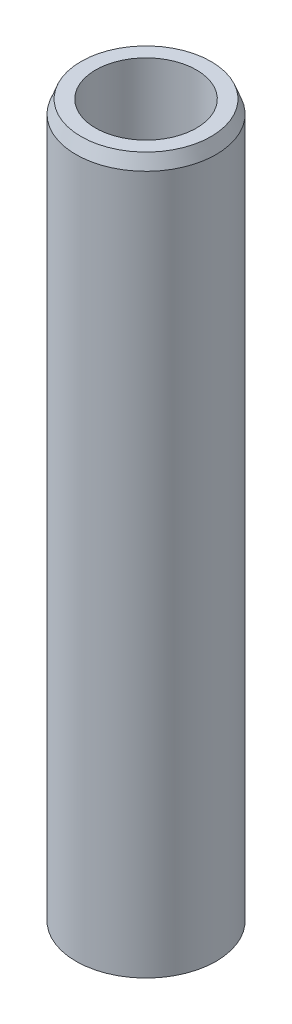
ISO-10303-21;
HEADER;
FILE_DESCRIPTION(('STEP AP214'),'2;1');
FILE_NAME('part.step','',(''),(''),'','','');
FILE_SCHEMA(('AUTOMOTIVE_DESIGN { 1 0 10303 214 1 1 1 1 }'));
ENDSEC;
DATA;
#1=APPLICATION_CONTEXT('core data for automotive mechanical design processes');
#2=APPLICATION_PROTOCOL_DEFINITION('international standard','automotive_design',2000,#1);
#3=PRODUCT_CONTEXT('',#1,'mechanical');
#4=PRODUCT('Part','Part','',(#3));
#5=PRODUCT_RELATED_PRODUCT_CATEGORY('part','',(#4));
#6=PRODUCT_DEFINITION_FORMATION('','',#4);
#7=PRODUCT_DEFINITION_CONTEXT('part definition',#1,'design');
#8=PRODUCT_DEFINITION('design','',#6,#7);
#9=PRODUCT_DEFINITION_SHAPE('','',#8);
#10=(LENGTH_UNIT() NAMED_UNIT(*) SI_UNIT(.MILLI.,.METRE.));
#11=(NAMED_UNIT(*) PLANE_ANGLE_UNIT() SI_UNIT($,.RADIAN.));
#12=(NAMED_UNIT(*) SI_UNIT($,.STERADIAN.) SOLID_ANGLE_UNIT());
#13=UNCERTAINTY_MEASURE_WITH_UNIT(LENGTH_MEASURE(1.E-05),#10,'distance_accuracy_value','');
#14=(GEOMETRIC_REPRESENTATION_CONTEXT(3) GLOBAL_UNCERTAINTY_ASSIGNED_CONTEXT((#13)) GLOBAL_UNIT_ASSIGNED_CONTEXT((#10,
#11,#12)) REPRESENTATION_CONTEXT('',''));
#15=CARTESIAN_POINT('',(0.,0.,0.));
#16=DIRECTION('',(0.,0.,1.));
#17=DIRECTION('',(1.,0.,0.));
#18=AXIS2_PLACEMENT_3D('',#15,#16,#17);
#19=CARTESIAN_POINT('',(0.,204.632580053421,0.));
#20=DIRECTION('',(0.,-1.,0.));
#21=DIRECTION('',(0.,0.,-1.));
#22=AXIS2_PLACEMENT_3D('',#19,#20,#21);
#23=CYLINDRICAL_SURFACE('',#22,20.);
#24=CARTESIAN_POINT('',(0.,200.891519500774,0.));
#25=DIRECTION('',(0.,1.,0.));
#26=DIRECTION('',(0.,0.,1.));
#27=AXIS2_PLACEMENT_3D('',#24,#25,#26);
#28=CIRCLE('',#27,20.);
#29=CARTESIAN_POINT('',(0.,200.891519500774,-20.));
#30=VERTEX_POINT('',#29);
#31=EDGE_CURVE('E50',#30,#30,#28,.F.);
#32=CARTESIAN_POINT('',(0.,1.43430570135733,0.));
#33=DIRECTION('',(0.,1.,0.));
#34=DIRECTION('',(0.,0.,1.));
#35=AXIS2_PLACEMENT_3D('',#32,#33,#34);
#36=CIRCLE('',#35,20.);
#37=CARTESIAN_POINT('',(0.,1.43430570135733,-20.));
#38=VERTEX_POINT('',#37);
#39=EDGE_CURVE('E51',#38,#38,#36,.T.);
#40=CARTESIAN_POINT('',(0.,200.891519500774,-20.));
#41=CARTESIAN_POINT('',(0.,198.813840190363,-20.));
#42=CARTESIAN_POINT('',(0.,196.736160879953,-20.));
#43=CARTESIAN_POINT('',(0.,192.580802259132,-20.));
#44=CARTESIAN_POINT('',(0.,190.503122948721,-20.));
#45=CARTESIAN_POINT('',(0.,186.3477643279,-20.));
#46=CARTESIAN_POINT('',(0.,184.270085017489,-20.));
#47=CARTESIAN_POINT('',(0.,180.114726396668,-20.));
#48=CARTESIAN_POINT('',(0.,178.037047086258,-20.));
#49=CARTESIAN_POINT('',(0.,173.881688465436,-20.));
#50=CARTESIAN_POINT('',(0.,171.804009155026,-20.));
#51=CARTESIAN_POINT('',(0.,167.648650534205,-20.));
#52=CARTESIAN_POINT('',(0.,165.570971223794,-20.));
#53=CARTESIAN_POINT('',(0.,161.415612602973,-20.));
#54=CARTESIAN_POINT('',(0.,159.337933292562,-20.));
#55=CARTESIAN_POINT('',(0.,155.182574671741,-20.));
#56=CARTESIAN_POINT('',(0.,153.10489536133,-20.));
#57=CARTESIAN_POINT('',(0.,148.949536740509,-20.));
#58=CARTESIAN_POINT('',(0.,146.871857430099,-20.));
#59=CARTESIAN_POINT('',(0.,142.716498809278,-20.));
#60=CARTESIAN_POINT('',(0.,140.638819498867,-20.));
#61=CARTESIAN_POINT('',(0.,136.483460878046,-20.));
#62=CARTESIAN_POINT('',(0.,134.405781567635,-20.));
#63=CARTESIAN_POINT('',(0.,130.250422946814,-20.));
#64=CARTESIAN_POINT('',(0.,128.172743636403,-20.));
#65=CARTESIAN_POINT('',(0.,124.017385015582,-20.));
#66=CARTESIAN_POINT('',(0.,121.939705705172,-20.));
#67=CARTESIAN_POINT('',(0.,117.78434708435,-20.));
#68=CARTESIAN_POINT('',(0.,115.70666777394,-20.));
#69=CARTESIAN_POINT('',(0.,111.551309153119,-20.));
#70=CARTESIAN_POINT('',(0.,109.473629842708,-20.));
#71=CARTESIAN_POINT('',(0.,105.318271221887,-20.));
#72=CARTESIAN_POINT('',(0.,103.240591911476,-20.));
#73=CARTESIAN_POINT('',(0.,99.0852332906551,-20.));
#74=CARTESIAN_POINT('',(0.,97.0075539802445,-20.));
#75=CARTESIAN_POINT('',(0.,92.8521953594233,-20.));
#76=CARTESIAN_POINT('',(0.,90.7745160490127,-20.));
#77=CARTESIAN_POINT('',(0.,86.6191574281916,-20.));
#78=CARTESIAN_POINT('',(0.,84.541478117781,-20.));
#79=CARTESIAN_POINT('',(0.,80.3861194969598,-20.));
#80=CARTESIAN_POINT('',(0.,78.3084401865492,-20.));
#81=CARTESIAN_POINT('',(0.,74.153081565728,-20.));
#82=CARTESIAN_POINT('',(0.,72.0754022553174,-20.));
#83=CARTESIAN_POINT('',(0.,67.9200436344962,-20.));
#84=CARTESIAN_POINT('',(0.,65.8423643240857,-20.));
#85=CARTESIAN_POINT('',(0.,61.6870057032645,-20.));
#86=CARTESIAN_POINT('',(0.,59.6093263928539,-20.));
#87=CARTESIAN_POINT('',(0.,55.4539677720327,-20.));
#88=CARTESIAN_POINT('',(0.,53.3762884616221,-20.));
#89=CARTESIAN_POINT('',(0.,49.2209298408009,-20.));
#90=CARTESIAN_POINT('',(0.,47.1432505303903,-20.));
#91=CARTESIAN_POINT('',(0.,42.9878919095691,-20.));
#92=CARTESIAN_POINT('',(0.,40.9102125991586,-20.));
#93=CARTESIAN_POINT('',(0.,36.7548539783374,-20.));
#94=CARTESIAN_POINT('',(0.,34.6771746679268,-20.));
#95=CARTESIAN_POINT('',(0.,30.5218160471056,-20.));
#96=CARTESIAN_POINT('',(0.,28.444136736695,-20.));
#97=CARTESIAN_POINT('',(0.,24.2887781158738,-20.));
#98=CARTESIAN_POINT('',(0.,22.2110988054632,-20.));
#99=CARTESIAN_POINT('',(0.,18.0557401846421,-20.));
#100=CARTESIAN_POINT('',(0.,15.9780608742315,-20.));
#101=CARTESIAN_POINT('',(0.,11.8227022534103,-20.));
#102=CARTESIAN_POINT('',(0.,9.7450229429997,-20.));
#103=CARTESIAN_POINT('',(0.,5.58966432217852,-20.));
#104=CARTESIAN_POINT('',(0.,3.51198501176792,-20.));
#105=CARTESIAN_POINT('',(0.,1.43430570135733,-20.));
#106=B_SPLINE_CURVE_WITH_KNOTS('',3,(#40,#41,#42,#43,#44,#45,#46,#47,#48,#49,#50,#51,#52,#53,
#54,#55,#56,#57,#58,#59,#60,#61,#62,#63,#64,#65,#66,#67,#68,#69,#70,#71,#72,#73,#74,#75,#76,#77,
#78,#79,#80,#81,#82,#83,#84,#85,#86,#87,#88,#89,#90,#91,#92,#93,#94,#95,#96,#97,#98,#99,#100,
#101,#102,#103,#104,#105),.UNSPECIFIED.,.F.,.F.,(4,2,2,2,2,2,2,2,2,2,2,2,2,2,2,2,2,2,2,2,2,2,2,
2,2,2,2,2,2,2,2,2,4),(0.,6.23303793123176,12.4660758624635,18.6991137936953,24.9321517249271,
31.1651896561589,37.3982275873906,43.6312655186224,49.8643034498542,56.0973413810859,
62.3303793123177,68.5634172435495,74.7964551747813,81.029493106013,87.2625310372448,
93.4955689684766,99.7286068997083,105.96164483094,112.194682762172,118.427720693404,
124.660758624635,130.893796555867,137.126834487099,143.359872418331,149.592910349563,
155.825948280794,162.058986212026,168.292024143258,174.52506207449,180.758100005721,
186.991137936953,193.224175868185,199.457213799417),.UNSPECIFIED.);
#107=EDGE_CURVE('BSEAM39',#30,#38,#106,.T.);
#108=ORIENTED_EDGE('',*,*,#31,.T.);
#109=ORIENTED_EDGE('',*,*,#39,.T.);
#110=ORIENTED_EDGE('',*,*,#107,.T.);
#111=ORIENTED_EDGE('',*,*,#107,.F.);
#112=EDGE_LOOP('',(#108,#110,#109,#111));
#113=FACE_BOUND('',#112,.T.);
#114=ADVANCED_FACE('F39',(#113),#23,.T.);
#115=CARTESIAN_POINT('',(0.,204.632580053421,0.));
#116=DIRECTION('',(0.,1.,0.));
#117=DIRECTION('',(0.,0.,1.));
#118=AXIS2_PLACEMENT_3D('',#115,#116,#117);
#119=PLANE('',#118);
#120=CARTESIAN_POINT('',(0.,204.632580053421,0.));
#121=DIRECTION('',(0.,1.,0.));
#122=DIRECTION('',(0.,0.,1.));
#123=AXIS2_PLACEMENT_3D('',#120,#121,#122);
#124=CIRCLE('',#123,18.5656942986428);
#125=CARTESIAN_POINT('',(0.,204.632580053421,18.5656942986428));
#126=VERTEX_POINT('',#125);
#127=EDGE_CURVE('E54',#126,#126,#124,.T.);
#128=ORIENTED_EDGE('',*,*,#127,.T.);
#129=EDGE_LOOP('',(#128));
#130=FACE_BOUND('',#129,.T.);
#131=CARTESIAN_POINT('',(0.,204.632580053421,0.));
#132=DIRECTION('',(0.,1.,0.));
#133=DIRECTION('',(0.,0.,1.));
#134=AXIS2_PLACEMENT_3D('',#131,#132,#133);
#135=CIRCLE('',#134,14.3952246288773);
#136=CARTESIAN_POINT('',(0.,204.632580053421,-14.3952246288773));
#137=VERTEX_POINT('',#136);
#138=EDGE_CURVE('E58',#137,#137,#135,.T.);
#139=ORIENTED_EDGE('',*,*,#138,.F.);
#140=EDGE_LOOP('',(#139));
#141=FACE_BOUND('',#140,.T.);
#142=ADVANCED_FACE('F69',(#130,#141),#119,.T.);
#143=CARTESIAN_POINT('',(0.,0.,0.));
#144=DIRECTION('',(0.,1.,0.));
#145=DIRECTION('',(0.,0.,1.));
#146=AXIS2_PLACEMENT_3D('',#143,#144,#145);
#147=PLANE('',#146);
#148=CARTESIAN_POINT('',(0.,0.,0.));
#149=DIRECTION('',(0.,1.,0.));
#150=DIRECTION('',(0.,0.,1.));
#151=AXIS2_PLACEMENT_3D('',#148,#149,#150);
#152=CIRCLE('',#151,16.2589394473524);
#153=CARTESIAN_POINT('',(0.,0.,16.2589394473524));
#154=VERTEX_POINT('',#153);
#155=EDGE_CURVE('E10',#154,#154,#152,.F.);
#156=ORIENTED_EDGE('',*,*,#155,.T.);
#157=EDGE_LOOP('',(#156));
#158=FACE_BOUND('',#157,.T.);
#159=CARTESIAN_POINT('',(0.,0.,0.));
#160=DIRECTION('',(0.,1.,0.));
#161=DIRECTION('',(0.,0.,1.));
#162=AXIS2_PLACEMENT_3D('',#159,#160,#161);
#163=CIRCLE('',#162,14.3952246288773);
#164=CARTESIAN_POINT('',(0.,0.,-14.3952246288773));
#165=VERTEX_POINT('',#164);
#166=EDGE_CURVE('E63',#165,#165,#163,.T.);
#167=ORIENTED_EDGE('',*,*,#166,.T.);
#168=EDGE_LOOP('',(#167));
#169=FACE_BOUND('',#168,.T.);
#170=ADVANCED_FACE('F75',(#158,#169),#147,.F.);
#171=CARTESIAN_POINT('',(0.,204.632580053421,0.));
#172=DIRECTION('',(0.,-1.,0.));
#173=DIRECTION('',(0.,0.,-1.));
#174=AXIS2_PLACEMENT_3D('',#171,#172,#173);
#175=CYLINDRICAL_SURFACE('',#174,14.3952246288773);
#176=CARTESIAN_POINT('',(0.,204.632580053421,-14.3952246288773));
#177=CARTESIAN_POINT('',(0.,202.500990677865,-14.3952246288773));
#178=CARTESIAN_POINT('',(0.,200.369401302308,-14.3952246288773));
#179=CARTESIAN_POINT('',(0.,196.106222551195,-14.3952246288773));
#180=CARTESIAN_POINT('',(0.,193.974633175639,-14.3952246288773));
#181=CARTESIAN_POINT('',(0.,189.711454424526,-14.3952246288773));
#182=CARTESIAN_POINT('',(0.,187.579865048969,-14.3952246288773));
#183=CARTESIAN_POINT('',(0.,183.316686297856,-14.3952246288773));
#184=CARTESIAN_POINT('',(0.,181.1850969223,-14.3952246288773));
#185=CARTESIAN_POINT('',(0.,176.921918171187,-14.3952246288773));
#186=CARTESIAN_POINT('',(0.,174.790328795631,-14.3952246288773));
#187=CARTESIAN_POINT('',(0.,170.527150044518,-14.3952246288773));
#188=CARTESIAN_POINT('',(0.,168.395560668961,-14.3952246288773));
#189=CARTESIAN_POINT('',(0.,164.132381917848,-14.3952246288773));
#190=CARTESIAN_POINT('',(0.,162.000792542292,-14.3952246288773));
#191=CARTESIAN_POINT('',(0.,157.737613791179,-14.3952246288773));
#192=CARTESIAN_POINT('',(0.,155.606024415622,-14.3952246288773));
#193=CARTESIAN_POINT('',(0.,151.342845664509,-14.3952246288773));
#194=CARTESIAN_POINT('',(0.,149.211256288953,-14.3952246288773));
#195=CARTESIAN_POINT('',(0.,144.94807753784,-14.3952246288773));
#196=CARTESIAN_POINT('',(0.,142.816488162284,-14.3952246288773));
#197=CARTESIAN_POINT('',(0.,138.553309411171,-14.3952246288773));
#198=CARTESIAN_POINT('',(0.,136.421720035614,-14.3952246288773));
#199=CARTESIAN_POINT('',(0.,132.158541284501,-14.3952246288773));
#200=CARTESIAN_POINT('',(0.,130.026951908945,-14.3952246288773));
#201=CARTESIAN_POINT('',(0.,125.763773157832,-14.3952246288773));
#202=CARTESIAN_POINT('',(0.,123.632183782275,-14.3952246288773));
#203=CARTESIAN_POINT('',(0.,119.369005031162,-14.3952246288773));
#204=CARTESIAN_POINT('',(0.,117.237415655606,-14.3952246288773));
#205=CARTESIAN_POINT('',(0.,112.974236904493,-14.3952246288773));
#206=CARTESIAN_POINT('',(0.,110.842647528936,-14.3952246288773));
#207=CARTESIAN_POINT('',(0.,106.579468777824,-14.3952246288773));
#208=CARTESIAN_POINT('',(0.,104.447879402267,-14.3952246288773));
#209=CARTESIAN_POINT('',(0.,100.184700651154,-14.3952246288773));
#210=CARTESIAN_POINT('',(0.,98.0531112755977,-14.3952246288773));
#211=CARTESIAN_POINT('',(0.,93.7899325244847,-14.3952246288773));
#212=CARTESIAN_POINT('',(0.,91.6583431489283,-14.3952246288773));
#213=CARTESIAN_POINT('',(0.,87.3951643978153,-14.3952246288773));
#214=CARTESIAN_POINT('',(0.,85.2635750222588,-14.3952246288773));
#215=CARTESIAN_POINT('',(0.,81.0003962711459,-14.3952246288773));
#216=CARTESIAN_POINT('',(0.,78.8688068955894,-14.3952246288773));
#217=CARTESIAN_POINT('',(0.,74.6056281444765,-14.3952246288773));
#218=CARTESIAN_POINT('',(0.,72.47403876892,-14.3952246288773));
#219=CARTESIAN_POINT('',(0.,68.2108600178071,-14.3952246288773));
#220=CARTESIAN_POINT('',(0.,66.0792706422506,-14.3952246288773));
#221=CARTESIAN_POINT('',(0.,61.8160918911376,-14.3952246288773));
#222=CARTESIAN_POINT('',(0.,59.6845025155812,-14.3952246288773));
#223=CARTESIAN_POINT('',(0.,55.4213237644682,-14.3952246288773));
#224=CARTESIAN_POINT('',(0.,53.2897343889118,-14.3952246288773));
#225=CARTESIAN_POINT('',(0.,49.0265556377988,-14.3952246288773));
#226=CARTESIAN_POINT('',(0.,46.8949662622424,-14.3952246288773));
#227=CARTESIAN_POINT('',(0.,42.6317875111294,-14.3952246288773));
#228=CARTESIAN_POINT('',(0.,40.5001981355729,-14.3952246288773));
#229=CARTESIAN_POINT('',(0.,36.23701938446,-14.3952246288773));
#230=CARTESIAN_POINT('',(0.,34.1054300089035,-14.3952246288773));
#231=CARTESIAN_POINT('',(0.,29.8422512577906,-14.3952246288773));
#232=CARTESIAN_POINT('',(0.,27.7106618822341,-14.3952246288773));
#233=CARTESIAN_POINT('',(0.,23.4474831311212,-14.3952246288773));
#234=CARTESIAN_POINT('',(0.,21.3158937555647,-14.3952246288773));
#235=CARTESIAN_POINT('',(0.,17.0527150044518,-14.3952246288773));
#236=CARTESIAN_POINT('',(0.,14.9211256288953,-14.3952246288773));
#237=CARTESIAN_POINT('',(0.,10.6579468777823,-14.3952246288773));
#238=CARTESIAN_POINT('',(0.,8.52635750222588,-14.3952246288773));
#239=CARTESIAN_POINT('',(0.,4.26317875111295,-14.3952246288773));
#240=CARTESIAN_POINT('',(0.,2.13158937555648,-14.3952246288773));
#241=CARTESIAN_POINT('',(0.,0.,-14.3952246288773));
#242=B_SPLINE_CURVE_WITH_KNOTS('',3,(#176,#177,#178,#179,#180,#181,#182,#183,#184,#185,#186,
#187,#188,#189,#190,#191,#192,#193,#194,#195,#196,#197,#198,#199,#200,#201,#202,#203,#204,#205,
#206,#207,#208,#209,#210,#211,#212,#213,#214,#215,#216,#217,#218,#219,#220,#221,#222,#223,#224,
#225,#226,#227,#228,#229,#230,#231,#232,#233,#234,#235,#236,#237,#238,#239,#240,#241),
.UNSPECIFIED.,.F.,.F.,(4,2,2,2,2,2,2,2,2,2,2,2,2,2,2,2,2,2,2,2,2,2,2,2,2,2,2,2,2,2,2,2,4),(0.,
6.39476812666939,12.7895362533388,19.1843043800082,25.5790725066776,31.973840633347,
38.3686087600165,44.7633768866859,51.1581450133553,57.5529131400247,63.9476812666941,
70.3424493933635,76.7372175200329,83.1319856467023,89.5267537733717,95.9215219000412,
102.316290026711,108.71105815338,115.105826280049,121.500594406719,127.895362533388,
134.290130660058,140.684898786727,147.079666913396,153.474435040066,159.869203166735,
166.263971293405,172.658739420074,179.053507546744,185.448275673413,191.843043800082,
198.237811926752,204.632580053421),.UNSPECIFIED.);
#243=EDGE_CURVE('BSEAM70',#137,#165,#242,.T.);
#244=ORIENTED_EDGE('',*,*,#138,.T.);
#245=ORIENTED_EDGE('',*,*,#166,.F.);
#246=ORIENTED_EDGE('',*,*,#243,.T.);
#247=ORIENTED_EDGE('',*,*,#243,.F.);
#248=EDGE_LOOP('',(#244,#246,#245,#247));
#249=FACE_BOUND('',#248,.T.);
#250=ADVANCED_FACE('F70',(#249),#175,.F.);
#251=CARTESIAN_POINT('',(0.,204.632580053421,0.));
#252=DIRECTION('',(0.,-1.,0.));
#253=DIRECTION('',(0.,0.,-1.));
#254=AXIS2_PLACEMENT_3D('',#251,#252,#253);
#255=CONICAL_SURFACE('',#254,18.5656942986428,0.366110698120383);
#256=ORIENTED_EDGE('',*,*,#31,.F.);
#257=EDGE_LOOP('',(#256));
#258=FACE_BOUND('',#257,.T.);
#259=ORIENTED_EDGE('',*,*,#127,.F.);
#260=EDGE_LOOP('',(#259));
#261=FACE_BOUND('',#260,.T.);
#262=ADVANCED_FACE('F81',(#258,#261),#255,.T.);
#263=CARTESIAN_POINT('',(0.,1.43430570135733,0.));
#264=DIRECTION('',(0.,1.,0.));
#265=DIRECTION('',(0.,0.,1.));
#266=AXIS2_PLACEMENT_3D('',#263,#264,#265);
#267=CONICAL_SURFACE('',#266,20.,1.20468562867451);
#268=ORIENTED_EDGE('',*,*,#155,.F.);
#269=EDGE_LOOP('',(#268));
#270=FACE_BOUND('',#269,.T.);
#271=ORIENTED_EDGE('',*,*,#39,.F.);
#272=EDGE_LOOP('',(#271));
#273=FACE_BOUND('',#272,.T.);
#274=ADVANCED_FACE('F45',(#270,#273),#267,.T.);
#275=CLOSED_SHELL('',(#114,#142,#170,#250,#262,#274));
#276=MANIFOLD_SOLID_BREP('B2',#275);
#277=ADVANCED_BREP_SHAPE_REPRESENTATION('',(#18,#276),#14);
#278=SHAPE_DEFINITION_REPRESENTATION(#9,#277);
ENDSEC;
END-ISO-10303-21;
